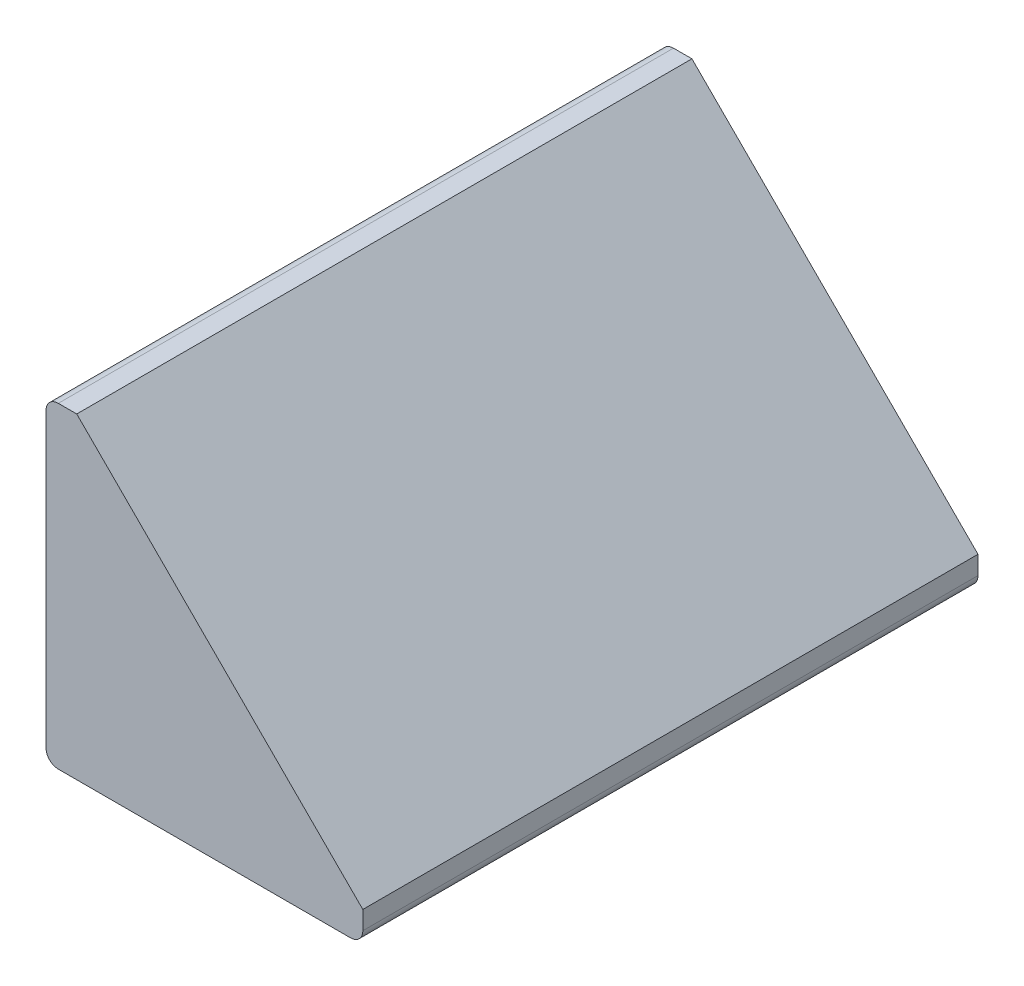
ISO-10303-21;
HEADER;
FILE_DESCRIPTION(('STEP AP214'),'2;1');
FILE_NAME('part.step','',(''),(''),'','','');
FILE_SCHEMA(('AUTOMOTIVE_DESIGN { 1 0 10303 214 1 1 1 1 }'));
ENDSEC;
DATA;
#1=APPLICATION_CONTEXT('core data for automotive mechanical design processes');
#2=APPLICATION_PROTOCOL_DEFINITION('international standard','automotive_design',2000,#1);
#3=PRODUCT_CONTEXT('',#1,'mechanical');
#4=PRODUCT('Part','Part','',(#3));
#5=PRODUCT_RELATED_PRODUCT_CATEGORY('part','',(#4));
#6=PRODUCT_DEFINITION_FORMATION('','',#4);
#7=PRODUCT_DEFINITION_CONTEXT('part definition',#1,'design');
#8=PRODUCT_DEFINITION('design','',#6,#7);
#9=PRODUCT_DEFINITION_SHAPE('','',#8);
#10=(LENGTH_UNIT() NAMED_UNIT(*) SI_UNIT(.MILLI.,.METRE.));
#11=(NAMED_UNIT(*) PLANE_ANGLE_UNIT() SI_UNIT($,.RADIAN.));
#12=(NAMED_UNIT(*) SI_UNIT($,.STERADIAN.) SOLID_ANGLE_UNIT());
#13=UNCERTAINTY_MEASURE_WITH_UNIT(LENGTH_MEASURE(1.E-05),#10,'distance_accuracy_value','');
#14=(GEOMETRIC_REPRESENTATION_CONTEXT(3) GLOBAL_UNCERTAINTY_ASSIGNED_CONTEXT((#13)) GLOBAL_UNIT_ASSIGNED_CONTEXT((#10,
#11,#12)) REPRESENTATION_CONTEXT('',''));
#15=CARTESIAN_POINT('',(0.,0.,0.));
#16=DIRECTION('',(0.,0.,1.));
#17=DIRECTION('',(1.,0.,0.));
#18=AXIS2_PLACEMENT_3D('',#15,#16,#17);
#19=CARTESIAN_POINT('',(0.,13.081,12.7));
#20=DIRECTION('',(0.,-1.,0.));
#21=DIRECTION('',(1.,0.,0.));
#22=AXIS2_PLACEMENT_3D('',#19,#20,#21);
#23=PLANE('',#22);
#24=DIRECTION('',(-1.,0.,0.));
#25=VECTOR('',#24,1.);
#26=CARTESIAN_POINT('',(0.,13.081,-12.7));
#27=LINE('',#26,#25);
#28=CARTESIAN_POINT('',(1.27,13.081,-12.7));
#29=VERTEX_POINT('',#28);
#30=CARTESIAN_POINT('',(0.508000000000003,13.081,-12.7));
#31=VERTEX_POINT('',#30);
#32=EDGE_CURVE('E130',#29,#31,#27,.T.);
#33=ORIENTED_EDGE('',*,*,#32,.T.);
#34=DIRECTION('',(0.,0.,-1.));
#35=VECTOR('',#34,1.);
#36=CARTESIAN_POINT('',(0.508000000000003,13.081,12.7));
#37=LINE('',#36,#35);
#38=CARTESIAN_POINT('',(0.508000000000003,13.081,12.7));
#39=VERTEX_POINT('',#38);
#40=EDGE_CURVE('E13',#31,#39,#37,.F.);
#41=ORIENTED_EDGE('',*,*,#40,.T.);
#42=DIRECTION('',(-1.,0.,0.));
#43=VECTOR('',#42,1.);
#44=CARTESIAN_POINT('',(0.,13.081,12.7));
#45=LINE('',#44,#43);
#46=CARTESIAN_POINT('',(1.27,13.081,12.7));
#47=VERTEX_POINT('',#46);
#48=EDGE_CURVE('E131',#47,#39,#45,.T.);
#49=ORIENTED_EDGE('',*,*,#48,.F.);
#50=DIRECTION('',(0.,0.,-1.));
#51=VECTOR('',#50,1.);
#52=CARTESIAN_POINT('',(1.27,13.081,12.7));
#53=LINE('',#52,#51);
#54=EDGE_CURVE('E125',#47,#29,#53,.T.);
#55=ORIENTED_EDGE('',*,*,#54,.T.);
#56=EDGE_LOOP('',(#33,#41,#49,#55));
#57=FACE_BOUND('',#56,.T.);
#58=ADVANCED_FACE('F42',(#57),#23,.F.);
#59=CARTESIAN_POINT('',(0.,13.081,12.7));
#60=DIRECTION('',(1.,0.,0.));
#61=DIRECTION('',(0.,1.,0.));
#62=AXIS2_PLACEMENT_3D('',#59,#60,#61);
#63=PLANE('',#62);
#64=DIRECTION('',(0.,-1.,0.));
#65=VECTOR('',#64,1.);
#66=CARTESIAN_POINT('',(0.,13.081,-12.7));
#67=LINE('',#66,#65);
#68=CARTESIAN_POINT('',(0.,12.573,-12.7));
#69=VERTEX_POINT('',#68);
#70=CARTESIAN_POINT('',(0.,0.508,-12.7));
#71=VERTEX_POINT('',#70);
#72=EDGE_CURVE('E167',#69,#71,#67,.T.);
#73=ORIENTED_EDGE('',*,*,#72,.T.);
#74=DIRECTION('',(0.,0.,-1.));
#75=VECTOR('',#74,1.);
#76=CARTESIAN_POINT('',(0.,0.508,12.7));
#77=LINE('',#76,#75);
#78=CARTESIAN_POINT('',(0.,0.508,12.7));
#79=VERTEX_POINT('',#78);
#80=EDGE_CURVE('E49',#71,#79,#77,.F.);
#81=ORIENTED_EDGE('',*,*,#80,.T.);
#82=DIRECTION('',(0.,-1.,0.));
#83=VECTOR('',#82,1.);
#84=CARTESIAN_POINT('',(0.,13.081,12.7));
#85=LINE('',#84,#83);
#86=CARTESIAN_POINT('',(0.,12.573,12.7));
#87=VERTEX_POINT('',#86);
#88=EDGE_CURVE('E133',#87,#79,#85,.T.);
#89=ORIENTED_EDGE('',*,*,#88,.F.);
#90=DIRECTION('',(0.,0.,-1.));
#91=VECTOR('',#90,1.);
#92=CARTESIAN_POINT('',(0.,12.573,12.7));
#93=LINE('',#92,#91);
#94=EDGE_CURVE('E162',#87,#69,#93,.T.);
#95=ORIENTED_EDGE('',*,*,#94,.T.);
#96=EDGE_LOOP('',(#73,#81,#89,#95));
#97=FACE_BOUND('',#96,.T.);
#98=ADVANCED_FACE('F166',(#97),#63,.F.);
#99=CARTESIAN_POINT('',(0.,0.,12.7));
#100=DIRECTION('',(0.,1.,0.));
#101=DIRECTION('',(-1.,0.,0.));
#102=AXIS2_PLACEMENT_3D('',#99,#100,#101);
#103=PLANE('',#102);
#104=DIRECTION('',(1.,0.,0.));
#105=VECTOR('',#104,1.);
#106=CARTESIAN_POINT('',(0.,0.,-12.7));
#107=LINE('',#106,#105);
#108=CARTESIAN_POINT('',(0.508,0.,-12.7));
#109=VERTEX_POINT('',#108);
#110=CARTESIAN_POINT('',(12.573,0.,-12.7));
#111=VERTEX_POINT('',#110);
#112=EDGE_CURVE('E118',#109,#111,#107,.T.);
#113=ORIENTED_EDGE('',*,*,#112,.T.);
#114=DIRECTION('',(0.,0.,-1.));
#115=VECTOR('',#114,1.);
#116=CARTESIAN_POINT('',(12.573,0.,12.7));
#117=LINE('',#116,#115);
#118=CARTESIAN_POINT('',(12.573,0.,12.7));
#119=VERTEX_POINT('',#118);
#120=EDGE_CURVE('E155',#111,#119,#117,.F.);
#121=ORIENTED_EDGE('',*,*,#120,.T.);
#122=DIRECTION('',(1.,0.,0.));
#123=VECTOR('',#122,1.);
#124=CARTESIAN_POINT('',(0.,0.,12.7));
#125=LINE('',#124,#123);
#126=CARTESIAN_POINT('',(0.508,0.,12.7));
#127=VERTEX_POINT('',#126);
#128=EDGE_CURVE('E138',#127,#119,#125,.T.);
#129=ORIENTED_EDGE('',*,*,#128,.F.);
#130=DIRECTION('',(0.,0.,-1.));
#131=VECTOR('',#130,1.);
#132=CARTESIAN_POINT('',(0.508,0.,12.7));
#133=LINE('',#132,#131);
#134=EDGE_CURVE('E152',#127,#109,#133,.T.);
#135=ORIENTED_EDGE('',*,*,#134,.T.);
#136=EDGE_LOOP('',(#113,#121,#129,#135));
#137=FACE_BOUND('',#136,.T.);
#138=ADVANCED_FACE('F190',(#137),#103,.F.);
#139=CARTESIAN_POINT('',(13.081,1.27,12.7));
#140=DIRECTION('',(-1.,0.,0.));
#141=DIRECTION('',(0.,-1.,0.));
#142=AXIS2_PLACEMENT_3D('',#139,#140,#141);
#143=PLANE('',#142);
#144=DIRECTION('',(0.,1.,0.));
#145=VECTOR('',#144,1.);
#146=CARTESIAN_POINT('',(13.081,1.27,12.7));
#147=LINE('',#146,#145);
#148=CARTESIAN_POINT('',(13.081,0.508000000000002,12.7));
#149=VERTEX_POINT('',#148);
#150=CARTESIAN_POINT('',(13.081,1.27,12.7));
#151=VERTEX_POINT('',#150);
#152=EDGE_CURVE('E141',#149,#151,#147,.T.);
#153=ORIENTED_EDGE('',*,*,#152,.F.);
#154=DIRECTION('',(0.,0.,-1.));
#155=VECTOR('',#154,1.);
#156=CARTESIAN_POINT('',(13.081,0.508000000000002,12.7));
#157=LINE('',#156,#155);
#158=CARTESIAN_POINT('',(13.081,0.508000000000002,-12.7));
#159=VERTEX_POINT('',#158);
#160=EDGE_CURVE('E114',#149,#159,#157,.T.);
#161=ORIENTED_EDGE('',*,*,#160,.T.);
#162=DIRECTION('',(0.,1.,0.));
#163=VECTOR('',#162,1.);
#164=CARTESIAN_POINT('',(13.081,1.27,-12.7));
#165=LINE('',#164,#163);
#166=CARTESIAN_POINT('',(13.081,1.27,-12.7));
#167=VERTEX_POINT('',#166);
#168=EDGE_CURVE('E107',#159,#167,#165,.T.);
#169=ORIENTED_EDGE('',*,*,#168,.T.);
#170=DIRECTION('',(0.,0.,-1.));
#171=VECTOR('',#170,1.);
#172=CARTESIAN_POINT('',(13.081,1.27,12.7));
#173=LINE('',#172,#171);
#174=EDGE_CURVE('E111',#151,#167,#173,.T.);
#175=ORIENTED_EDGE('',*,*,#174,.F.);
#176=EDGE_LOOP('',(#153,#161,#169,#175));
#177=FACE_BOUND('',#176,.T.);
#178=ADVANCED_FACE('F110',(#177),#143,.F.);
#179=CARTESIAN_POINT('',(1.27,13.081,12.7));
#180=DIRECTION('',(-0.707106781186548,-0.707106781186547,0.));
#181=DIRECTION('',(0.707106781186547,-0.707106781186548,0.));
#182=AXIS2_PLACEMENT_3D('',#179,#180,#181);
#183=PLANE('',#182);
#184=DIRECTION('',(-0.707106781186547,0.707106781186548,0.));
#185=VECTOR('',#184,1.);
#186=CARTESIAN_POINT('',(1.27,13.081,-12.7));
#187=LINE('',#186,#185);
#188=EDGE_CURVE('E117',#167,#29,#187,.T.);
#189=ORIENTED_EDGE('',*,*,#188,.T.);
#190=ORIENTED_EDGE('',*,*,#54,.F.);
#191=DIRECTION('',(-0.707106781186547,0.707106781186548,0.));
#192=VECTOR('',#191,1.);
#193=CARTESIAN_POINT('',(1.27,13.081,12.7));
#194=LINE('',#193,#192);
#195=EDGE_CURVE('E124',#151,#47,#194,.T.);
#196=ORIENTED_EDGE('',*,*,#195,.F.);
#197=ORIENTED_EDGE('',*,*,#174,.T.);
#198=EDGE_LOOP('',(#189,#190,#196,#197));
#199=FACE_BOUND('',#198,.T.);
#200=ADVANCED_FACE('F121',(#199),#183,.F.);
#201=CARTESIAN_POINT('',(0.,13.081,12.7));
#202=DIRECTION('',(0.,0.,-1.));
#203=DIRECTION('',(-1.,0.,0.));
#204=AXIS2_PLACEMENT_3D('',#201,#202,#203);
#205=PLANE('',#204);
#206=ORIENTED_EDGE('',*,*,#128,.T.);
#207=CARTESIAN_POINT('',(12.573,0.508,12.7));
#208=DIRECTION('',(0.,0.,-1.));
#209=DIRECTION('',(-1.,0.,0.));
#210=AXIS2_PLACEMENT_3D('',#207,#208,#209);
#211=CIRCLE('',#210,0.508);
#212=EDGE_CURVE('E160',#119,#149,#211,.F.);
#213=ORIENTED_EDGE('',*,*,#212,.T.);
#214=ORIENTED_EDGE('',*,*,#152,.T.);
#215=ORIENTED_EDGE('',*,*,#195,.T.);
#216=ORIENTED_EDGE('',*,*,#48,.T.);
#217=CARTESIAN_POINT('',(0.508000000000002,12.573,12.7));
#218=DIRECTION('',(0.,0.,-1.));
#219=DIRECTION('',(-1.,0.,0.));
#220=AXIS2_PLACEMENT_3D('',#217,#218,#219);
#221=CIRCLE('',#220,0.508);
#222=EDGE_CURVE('E62',#39,#87,#221,.F.);
#223=ORIENTED_EDGE('',*,*,#222,.T.);
#224=ORIENTED_EDGE('',*,*,#88,.T.);
#225=CARTESIAN_POINT('',(0.508,0.508,12.7));
#226=DIRECTION('',(0.,0.,-1.));
#227=DIRECTION('',(-1.,0.,0.));
#228=AXIS2_PLACEMENT_3D('',#225,#226,#227);
#229=CIRCLE('',#228,0.508);
#230=EDGE_CURVE('E158',#79,#127,#229,.F.);
#231=ORIENTED_EDGE('',*,*,#230,.T.);
#232=EDGE_LOOP('',(#206,#213,#214,#215,#216,#223,#224,#231));
#233=FACE_BOUND('',#232,.T.);
#234=ADVANCED_FACE('F201',(#233),#205,.F.);
#235=CARTESIAN_POINT('',(0.,13.081,-12.7));
#236=DIRECTION('',(0.,0.,-1.));
#237=DIRECTION('',(-1.,0.,0.));
#238=AXIS2_PLACEMENT_3D('',#235,#236,#237);
#239=PLANE('',#238);
#240=ORIENTED_EDGE('',*,*,#168,.F.);
#241=CARTESIAN_POINT('',(12.573,0.508,-12.7));
#242=DIRECTION('',(0.,0.,-1.));
#243=DIRECTION('',(-1.,0.,0.));
#244=AXIS2_PLACEMENT_3D('',#241,#242,#243);
#245=CIRCLE('',#244,0.508);
#246=EDGE_CURVE('E150',#159,#111,#245,.T.);
#247=ORIENTED_EDGE('',*,*,#246,.T.);
#248=ORIENTED_EDGE('',*,*,#112,.F.);
#249=CARTESIAN_POINT('',(0.508,0.508,-12.7));
#250=DIRECTION('',(0.,0.,-1.));
#251=DIRECTION('',(-1.,0.,0.));
#252=AXIS2_PLACEMENT_3D('',#249,#250,#251);
#253=CIRCLE('',#252,0.508);
#254=EDGE_CURVE('E148',#109,#71,#253,.T.);
#255=ORIENTED_EDGE('',*,*,#254,.T.);
#256=ORIENTED_EDGE('',*,*,#72,.F.);
#257=CARTESIAN_POINT('',(0.508000000000002,12.573,-12.7));
#258=DIRECTION('',(0.,0.,-1.));
#259=DIRECTION('',(-1.,0.,0.));
#260=AXIS2_PLACEMENT_3D('',#257,#258,#259);
#261=CIRCLE('',#260,0.508);
#262=EDGE_CURVE('E146',#69,#31,#261,.T.);
#263=ORIENTED_EDGE('',*,*,#262,.T.);
#264=ORIENTED_EDGE('',*,*,#32,.F.);
#265=ORIENTED_EDGE('',*,*,#188,.F.);
#266=EDGE_LOOP('',(#240,#247,#248,#255,#256,#263,#264,#265));
#267=FACE_BOUND('',#266,.T.);
#268=ADVANCED_FACE('F128',(#267),#239,.T.);
#269=CARTESIAN_POINT('',(12.573,0.508,12.7));
#270=DIRECTION('',(0.,0.,-1.));
#271=DIRECTION('',(-1.,0.,0.));
#272=AXIS2_PLACEMENT_3D('',#269,#270,#271);
#273=CYLINDRICAL_SURFACE('',#272,0.508);
#274=ORIENTED_EDGE('',*,*,#212,.F.);
#275=ORIENTED_EDGE('',*,*,#120,.F.);
#276=ORIENTED_EDGE('',*,*,#246,.F.);
#277=ORIENTED_EDGE('',*,*,#160,.F.);
#278=EDGE_LOOP('',(#274,#275,#276,#277));
#279=FACE_BOUND('',#278,.T.);
#280=ADVANCED_FACE('F183',(#279),#273,.T.);
#281=CARTESIAN_POINT('',(0.508,0.508,12.7));
#282=DIRECTION('',(0.,0.,-1.));
#283=DIRECTION('',(-1.,0.,0.));
#284=AXIS2_PLACEMENT_3D('',#281,#282,#283);
#285=CYLINDRICAL_SURFACE('',#284,0.508);
#286=ORIENTED_EDGE('',*,*,#230,.F.);
#287=ORIENTED_EDGE('',*,*,#80,.F.);
#288=ORIENTED_EDGE('',*,*,#254,.F.);
#289=ORIENTED_EDGE('',*,*,#134,.F.);
#290=EDGE_LOOP('',(#286,#287,#288,#289));
#291=FACE_BOUND('',#290,.T.);
#292=ADVANCED_FACE('F178',(#291),#285,.T.);
#293=CARTESIAN_POINT('',(0.508000000000002,12.573,12.7));
#294=DIRECTION('',(0.,0.,-1.));
#295=DIRECTION('',(-1.,0.,0.));
#296=AXIS2_PLACEMENT_3D('',#293,#294,#295);
#297=CYLINDRICAL_SURFACE('',#296,0.508);
#298=ORIENTED_EDGE('',*,*,#222,.F.);
#299=ORIENTED_EDGE('',*,*,#40,.F.);
#300=ORIENTED_EDGE('',*,*,#262,.F.);
#301=ORIENTED_EDGE('',*,*,#94,.F.);
#302=EDGE_LOOP('',(#298,#299,#300,#301));
#303=FACE_BOUND('',#302,.T.);
#304=ADVANCED_FACE('F176',(#303),#297,.T.);
#305=CLOSED_SHELL('',(#58,#98,#138,#178,#200,#234,#268,#280,#292,#304));
#306=MANIFOLD_SOLID_BREP('B2',#305);
#307=ADVANCED_BREP_SHAPE_REPRESENTATION('',(#18,#306),#14);
#308=SHAPE_DEFINITION_REPRESENTATION(#9,#307);
ENDSEC;
END-ISO-10303-21;
